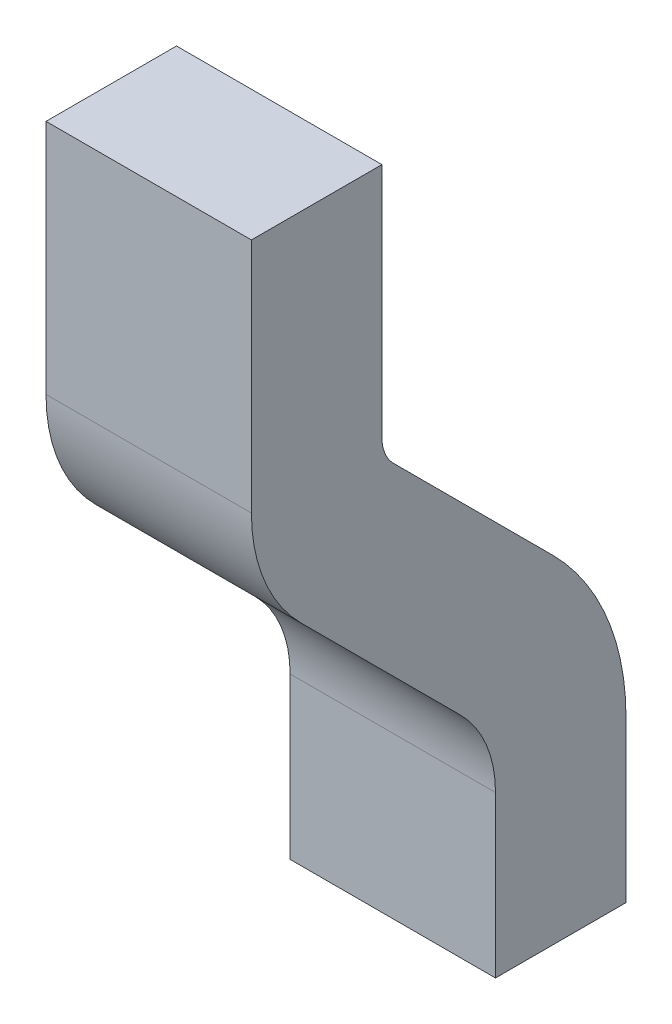
ISO-10303-21;
HEADER;
FILE_DESCRIPTION(('STEP AP214'),'2;1');
FILE_NAME('part.step','',(''),(''),'','','');
FILE_SCHEMA(('AUTOMOTIVE_DESIGN { 1 0 10303 214 1 1 1 1 }'));
ENDSEC;
DATA;
#1=APPLICATION_CONTEXT('core data for automotive mechanical design processes');
#2=APPLICATION_PROTOCOL_DEFINITION('international standard','automotive_design',2000,#1);
#3=PRODUCT_CONTEXT('',#1,'mechanical');
#4=PRODUCT('Part','Part','',(#3));
#5=PRODUCT_RELATED_PRODUCT_CATEGORY('part','',(#4));
#6=PRODUCT_DEFINITION_FORMATION('','',#4);
#7=PRODUCT_DEFINITION_CONTEXT('part definition',#1,'design');
#8=PRODUCT_DEFINITION('design','',#6,#7);
#9=PRODUCT_DEFINITION_SHAPE('','',#8);
#10=(LENGTH_UNIT() NAMED_UNIT(*) SI_UNIT(.MILLI.,.METRE.));
#11=(NAMED_UNIT(*) PLANE_ANGLE_UNIT() SI_UNIT($,.RADIAN.));
#12=(NAMED_UNIT(*) SI_UNIT($,.STERADIAN.) SOLID_ANGLE_UNIT());
#13=UNCERTAINTY_MEASURE_WITH_UNIT(LENGTH_MEASURE(1.E-05),#10,'distance_accuracy_value','');
#14=(GEOMETRIC_REPRESENTATION_CONTEXT(3) GLOBAL_UNCERTAINTY_ASSIGNED_CONTEXT((#13)) GLOBAL_UNIT_ASSIGNED_CONTEXT((#10,
#11,#12)) REPRESENTATION_CONTEXT('',''));
#15=CARTESIAN_POINT('',(0.,0.,0.));
#16=DIRECTION('',(0.,0.,1.));
#17=DIRECTION('',(1.,0.,0.));
#18=AXIS2_PLACEMENT_3D('',#15,#16,#17);
#19=CARTESIAN_POINT('',(5.005,-1.00000000000062,0.54));
#20=DIRECTION('',(0.,0.,1.));
#21=DIRECTION('',(0.707106781186548,0.707106781186548,0.));
#22=AXIS2_PLACEMENT_3D('',#19,#20,#21);
#23=PLANE('',#22);
#24=DIRECTION('',(0.,1.,0.));
#25=VECTOR('',#24,1.);
#26=CARTESIAN_POINT('',(5.005,-1.00000000000062,0.54));
#27=LINE('',#26,#25);
#28=CARTESIAN_POINT('',(5.005,-1.00000000000062,0.54));
#29=VERTEX_POINT('',#28);
#30=CARTESIAN_POINT('',(5.005,-0.335269905174204,0.54));
#31=VERTEX_POINT('',#30);
#32=EDGE_CURVE('E11',#29,#31,#27,.T.);
#33=ORIENTED_EDGE('',*,*,#32,.T.);
#34=DIRECTION('',(-1.,0.,0.));
#35=VECTOR('',#34,1.);
#36=CARTESIAN_POINT('',(5.005,-0.335269905174204,0.54));
#37=LINE('',#36,#35);
#38=CARTESIAN_POINT('',(4.155,-0.335269905174204,0.54));
#39=VERTEX_POINT('',#38);
#40=EDGE_CURVE('E26',#31,#39,#37,.T.);
#41=ORIENTED_EDGE('',*,*,#40,.T.);
#42=DIRECTION('',(0.,1.,0.));
#43=VECTOR('',#42,1.);
#44=CARTESIAN_POINT('',(4.155,-1.00000000000062,0.54));
#45=LINE('',#44,#43);
#46=CARTESIAN_POINT('',(4.155,-1.00000000000062,0.54));
#47=VERTEX_POINT('',#46);
#48=EDGE_CURVE('E172',#47,#39,#45,.T.);
#49=ORIENTED_EDGE('',*,*,#48,.F.);
#50=DIRECTION('',(-1.,0.,0.));
#51=VECTOR('',#50,1.);
#52=CARTESIAN_POINT('',(5.005,-1.00000000000062,0.54));
#53=LINE('',#52,#51);
#54=EDGE_CURVE('E113',#29,#47,#53,.T.);
#55=ORIENTED_EDGE('',*,*,#54,.F.);
#56=EDGE_LOOP('',(#33,#41,#49,#55));
#57=FACE_BOUND('',#56,.T.);
#58=ADVANCED_FACE('F16',(#57),#23,.T.);
#59=CARTESIAN_POINT('',(5.005,0.,0.));
#60=DIRECTION('',(-1.,0.,0.));
#61=DIRECTION('',(0.,0.707106781186548,0.707106781186548));
#62=AXIS2_PLACEMENT_3D('',#59,#60,#61);
#63=PLANE('',#62);
#64=DIRECTION('',(0.,0.,1.));
#65=VECTOR('',#64,1.);
#66=CARTESIAN_POINT('',(5.005,-1.00000000000062,0.));
#67=LINE('',#66,#65);
#68=CARTESIAN_POINT('',(5.005,-1.00000000000062,0.));
#69=VERTEX_POINT('',#68);
#70=EDGE_CURVE('E116',#69,#29,#67,.T.);
#71=ORIENTED_EDGE('',*,*,#70,.F.);
#72=DIRECTION('',(0.,-1.,0.));
#73=VECTOR('',#72,1.);
#74=CARTESIAN_POINT('',(5.005,-0.335269905174204,0.));
#75=LINE('',#74,#73);
#76=CARTESIAN_POINT('',(5.005,-0.335269905174204,0.));
#77=VERTEX_POINT('',#76);
#78=EDGE_CURVE('E125',#77,#69,#75,.T.);
#79=ORIENTED_EDGE('',*,*,#78,.F.);
#80=CARTESIAN_POINT('',(5.005,-0.335269905174204,1.03522017196621));
#81=DIRECTION('',(-1.,0.,0.));
#82=DIRECTION('',(0.,0.707106780945768,-0.707106781427327));
#83=AXIS2_PLACEMENT_3D('',#80,#81,#82);
#84=CIRCLE('',#83,1.03522017196621);
#85=CARTESIAN_POINT('',(5.005,0.396741298194948,0.30320896809854));
#86=VERTEX_POINT('',#85);
#87=EDGE_CURVE('E127',#86,#77,#84,.T.);
#88=ORIENTED_EDGE('',*,*,#87,.F.);
#89=DIRECTION('',(0.,-0.707106781186547,-0.707106781186548));
#90=VECTOR('',#89,1.);
#91=CARTESIAN_POINT('',(5.005,1.05561303280654,0.962080702530221));
#92=LINE('',#91,#90);
#93=CARTESIAN_POINT('',(5.005,1.05561303280654,0.962080702530221));
#94=VERTEX_POINT('',#93);
#95=EDGE_CURVE('E134',#94,#86,#92,.T.);
#96=ORIENTED_EDGE('',*,*,#95,.F.);
#97=CARTESIAN_POINT('',(5.005,1.17130045081576,0.846393284401388));
#98=DIRECTION('',(1.,0.,0.));
#99=DIRECTION('',(0.,0.,1.));
#100=AXIS2_PLACEMENT_3D('',#97,#98,#99);
#101=CIRCLE('',#100,0.163606715598613);
#102=CARTESIAN_POINT('',(5.005,1.17130045081576,1.01));
#103=VERTEX_POINT('',#102);
#104=EDGE_CURVE('E138',#103,#94,#101,.T.);
#105=ORIENTED_EDGE('',*,*,#104,.F.);
#106=DIRECTION('',(0.,-1.,0.));
#107=VECTOR('',#106,1.);
#108=CARTESIAN_POINT('',(5.005,2.14999999999938,1.01));
#109=LINE('',#108,#107);
#110=CARTESIAN_POINT('',(5.005,2.14999999999938,1.01));
#111=VERTEX_POINT('',#110);
#112=EDGE_CURVE('E142',#111,#103,#109,.T.);
#113=ORIENTED_EDGE('',*,*,#112,.F.);
#114=DIRECTION('',(0.,0.,-1.));
#115=VECTOR('',#114,1.);
#116=CARTESIAN_POINT('',(5.005,2.14999999999938,1.55));
#117=LINE('',#116,#115);
#118=CARTESIAN_POINT('',(5.005,2.14999999999938,1.55));
#119=VERTEX_POINT('',#118);
#120=EDGE_CURVE('E146',#119,#111,#117,.T.);
#121=ORIENTED_EDGE('',*,*,#120,.F.);
#122=DIRECTION('',(0.,1.,0.));
#123=VECTOR('',#122,1.);
#124=CARTESIAN_POINT('',(5.005,1.17130045081576,1.55));
#125=LINE('',#124,#123);
#126=CARTESIAN_POINT('',(5.005,1.17130045081576,1.55));
#127=VERTEX_POINT('',#126);
#128=EDGE_CURVE('E150',#127,#119,#125,.T.);
#129=ORIENTED_EDGE('',*,*,#128,.F.);
#130=CARTESIAN_POINT('',(5.005,1.17130045081576,0.846393284401388));
#131=DIRECTION('',(-1.,0.,0.));
#132=DIRECTION('',(0.,-0.707106780820972,0.707106781552123));
#133=AXIS2_PLACEMENT_3D('',#130,#131,#132);
#134=CIRCLE('',#133,0.703606715598613);
#135=CARTESIAN_POINT('',(5.005,0.673775371184803,1.34391836454678));
#136=VERTEX_POINT('',#135);
#137=EDGE_CURVE('E153',#136,#127,#134,.T.);
#138=ORIENTED_EDGE('',*,*,#137,.F.);
#139=DIRECTION('',(0.,0.707106781186547,0.707106781186548));
#140=VECTOR('',#139,1.);
#141=CARTESIAN_POINT('',(5.005,0.0149036364441688,0.685046629849319));
#142=LINE('',#141,#140);
#143=CARTESIAN_POINT('',(5.005,0.0149036364441688,0.685046629849319));
#144=VERTEX_POINT('',#143);
#145=EDGE_CURVE('E156',#144,#136,#142,.T.);
#146=ORIENTED_EDGE('',*,*,#145,.F.);
#147=CARTESIAN_POINT('',(5.005,-0.335269905174204,1.03522017196621));
#148=DIRECTION('',(1.,0.,0.));
#149=DIRECTION('',(0.,0.,-1.));
#150=AXIS2_PLACEMENT_3D('',#147,#148,#149);
#151=CIRCLE('',#150,0.495220171966211);
#152=EDGE_CURVE('E167',#31,#144,#151,.T.);
#153=ORIENTED_EDGE('',*,*,#152,.F.);
#154=ORIENTED_EDGE('',*,*,#32,.F.);
#155=EDGE_LOOP('',(#71,#79,#88,#96,#105,#113,#121,#129,#138,#146,#153,#154));
#156=FACE_BOUND('',#155,.T.);
#157=ADVANCED_FACE('F204',(#156),#63,.F.);
#158=CARTESIAN_POINT('',(5.005,-0.335269905174204,1.03522017196621));
#159=DIRECTION('',(1.,0.,0.));
#160=DIRECTION('',(0.,0.,-1.));
#161=AXIS2_PLACEMENT_3D('',#158,#159,#160);
#162=CYLINDRICAL_SURFACE('',#161,0.495220171966211);
#163=ORIENTED_EDGE('',*,*,#152,.T.);
#164=DIRECTION('',(-1.,0.,0.));
#165=VECTOR('',#164,1.);
#166=CARTESIAN_POINT('',(5.005,0.0149036364441688,0.685046629849319));
#167=LINE('',#166,#165);
#168=CARTESIAN_POINT('',(4.155,0.0149036364441688,0.685046629849319));
#169=VERTEX_POINT('',#168);
#170=EDGE_CURVE('E169',#144,#169,#167,.T.);
#171=ORIENTED_EDGE('',*,*,#170,.T.);
#172=CARTESIAN_POINT('',(4.155,-0.335269905174204,1.03522017196621));
#173=DIRECTION('',(1.,0.,0.));
#174=DIRECTION('',(0.,0.,-1.));
#175=AXIS2_PLACEMENT_3D('',#172,#173,#174);
#176=CIRCLE('',#175,0.495220171966211);
#177=EDGE_CURVE('E173',#39,#169,#176,.T.);
#178=ORIENTED_EDGE('',*,*,#177,.F.);
#179=ORIENTED_EDGE('',*,*,#40,.F.);
#180=EDGE_LOOP('',(#163,#171,#178,#179));
#181=FACE_BOUND('',#180,.T.);
#182=ADVANCED_FACE('F227',(#181),#162,.F.);
#183=CARTESIAN_POINT('',(4.155,0.,0.));
#184=DIRECTION('',(-1.,0.,0.));
#185=DIRECTION('',(0.,0.707106781186548,0.707106781186548));
#186=AXIS2_PLACEMENT_3D('',#183,#184,#185);
#187=PLANE('',#186);
#188=ORIENTED_EDGE('',*,*,#48,.T.);
#189=ORIENTED_EDGE('',*,*,#177,.T.);
#190=DIRECTION('',(0.,0.707106781186547,0.707106781186548));
#191=VECTOR('',#190,1.);
#192=CARTESIAN_POINT('',(4.155,0.0149036364441688,0.685046629849319));
#193=LINE('',#192,#191);
#194=CARTESIAN_POINT('',(4.155,0.673775371184803,1.34391836454678));
#195=VERTEX_POINT('',#194);
#196=EDGE_CURVE('E175',#169,#195,#193,.T.);
#197=ORIENTED_EDGE('',*,*,#196,.T.);
#198=CARTESIAN_POINT('',(4.155,1.17130045081576,0.846393284401388));
#199=DIRECTION('',(-1.,0.,0.));
#200=DIRECTION('',(0.,-0.707106780820972,0.707106781552123));
#201=AXIS2_PLACEMENT_3D('',#198,#199,#200);
#202=CIRCLE('',#201,0.703606715598613);
#203=CARTESIAN_POINT('',(4.155,1.17130045081576,1.55));
#204=VERTEX_POINT('',#203);
#205=EDGE_CURVE('E178',#195,#204,#202,.T.);
#206=ORIENTED_EDGE('',*,*,#205,.T.);
#207=DIRECTION('',(0.,1.,0.));
#208=VECTOR('',#207,1.);
#209=CARTESIAN_POINT('',(4.155,1.17130045081576,1.55));
#210=LINE('',#209,#208);
#211=CARTESIAN_POINT('',(4.155,2.14999999999938,1.55));
#212=VERTEX_POINT('',#211);
#213=EDGE_CURVE('E181',#204,#212,#210,.T.);
#214=ORIENTED_EDGE('',*,*,#213,.T.);
#215=DIRECTION('',(0.,0.,-1.));
#216=VECTOR('',#215,1.);
#217=CARTESIAN_POINT('',(4.155,2.14999999999938,1.55));
#218=LINE('',#217,#216);
#219=CARTESIAN_POINT('',(4.155,2.14999999999938,1.01));
#220=VERTEX_POINT('',#219);
#221=EDGE_CURVE('E184',#212,#220,#218,.T.);
#222=ORIENTED_EDGE('',*,*,#221,.T.);
#223=DIRECTION('',(0.,-1.,0.));
#224=VECTOR('',#223,1.);
#225=CARTESIAN_POINT('',(4.155,2.14999999999938,1.01));
#226=LINE('',#225,#224);
#227=CARTESIAN_POINT('',(4.155,1.17130045081576,1.01));
#228=VERTEX_POINT('',#227);
#229=EDGE_CURVE('E187',#220,#228,#226,.T.);
#230=ORIENTED_EDGE('',*,*,#229,.T.);
#231=CARTESIAN_POINT('',(4.155,1.17130045081576,0.846393284401388));
#232=DIRECTION('',(1.,0.,0.));
#233=DIRECTION('',(0.,0.,1.));
#234=AXIS2_PLACEMENT_3D('',#231,#232,#233);
#235=CIRCLE('',#234,0.163606715598613);
#236=CARTESIAN_POINT('',(4.155,1.05561303280654,0.962080702530221));
#237=VERTEX_POINT('',#236);
#238=EDGE_CURVE('E190',#228,#237,#235,.T.);
#239=ORIENTED_EDGE('',*,*,#238,.T.);
#240=DIRECTION('',(0.,-0.707106781186547,-0.707106781186548));
#241=VECTOR('',#240,1.);
#242=CARTESIAN_POINT('',(4.155,1.05561303280654,0.962080702530221));
#243=LINE('',#242,#241);
#244=CARTESIAN_POINT('',(4.155,0.396741298194948,0.30320896809854));
#245=VERTEX_POINT('',#244);
#246=EDGE_CURVE('E193',#237,#245,#243,.T.);
#247=ORIENTED_EDGE('',*,*,#246,.T.);
#248=CARTESIAN_POINT('',(4.155,-0.335269905174204,1.03522017196621));
#249=DIRECTION('',(-1.,0.,0.));
#250=DIRECTION('',(0.,0.707106780945768,-0.707106781427327));
#251=AXIS2_PLACEMENT_3D('',#248,#249,#250);
#252=CIRCLE('',#251,1.03522017196621);
#253=CARTESIAN_POINT('',(4.155,-0.335269905174204,0.));
#254=VERTEX_POINT('',#253);
#255=EDGE_CURVE('E120',#245,#254,#252,.T.);
#256=ORIENTED_EDGE('',*,*,#255,.T.);
#257=DIRECTION('',(0.,-1.,0.));
#258=VECTOR('',#257,1.);
#259=CARTESIAN_POINT('',(4.155,-0.335269905174204,0.));
#260=LINE('',#259,#258);
#261=CARTESIAN_POINT('',(4.155,-1.00000000000062,0.));
#262=VERTEX_POINT('',#261);
#263=EDGE_CURVE('E102',#254,#262,#260,.T.);
#264=ORIENTED_EDGE('',*,*,#263,.T.);
#265=DIRECTION('',(0.,0.,1.));
#266=VECTOR('',#265,1.);
#267=CARTESIAN_POINT('',(4.155,-1.00000000000062,0.));
#268=LINE('',#267,#266);
#269=EDGE_CURVE('E108',#262,#47,#268,.T.);
#270=ORIENTED_EDGE('',*,*,#269,.T.);
#271=EDGE_LOOP('',(#188,#189,#197,#206,#214,#222,#230,#239,#247,#256,#264,#270));
#272=FACE_BOUND('',#271,.T.);
#273=ADVANCED_FACE('F118',(#272),#187,.T.);
#274=CARTESIAN_POINT('',(5.005,-1.00000000000062,0.));
#275=DIRECTION('',(0.,-1.,0.));
#276=DIRECTION('',(0.707106781186548,0.,0.707106781186548));
#277=AXIS2_PLACEMENT_3D('',#274,#275,#276);
#278=PLANE('',#277);
#279=ORIENTED_EDGE('',*,*,#70,.T.);
#280=ORIENTED_EDGE('',*,*,#54,.T.);
#281=ORIENTED_EDGE('',*,*,#269,.F.);
#282=DIRECTION('',(-1.,0.,0.));
#283=VECTOR('',#282,1.);
#284=CARTESIAN_POINT('',(5.005,-1.00000000000062,0.));
#285=LINE('',#284,#283);
#286=EDGE_CURVE('E111',#69,#262,#285,.T.);
#287=ORIENTED_EDGE('',*,*,#286,.F.);
#288=EDGE_LOOP('',(#279,#280,#281,#287));
#289=FACE_BOUND('',#288,.T.);
#290=ADVANCED_FACE('F110',(#289),#278,.T.);
#291=CARTESIAN_POINT('',(5.005,-0.335269905174204,0.));
#292=DIRECTION('',(0.,0.,-1.));
#293=DIRECTION('',(0.707106781186548,0.707106781186548,0.));
#294=AXIS2_PLACEMENT_3D('',#291,#292,#293);
#295=PLANE('',#294);
#296=ORIENTED_EDGE('',*,*,#78,.T.);
#297=ORIENTED_EDGE('',*,*,#286,.T.);
#298=ORIENTED_EDGE('',*,*,#263,.F.);
#299=DIRECTION('',(-1.,0.,0.));
#300=VECTOR('',#299,1.);
#301=CARTESIAN_POINT('',(5.005,-0.335269905174204,0.));
#302=LINE('',#301,#300);
#303=EDGE_CURVE('E130',#77,#254,#302,.T.);
#304=ORIENTED_EDGE('',*,*,#303,.F.);
#305=EDGE_LOOP('',(#296,#297,#298,#304));
#306=FACE_BOUND('',#305,.T.);
#307=ADVANCED_FACE('F123',(#306),#295,.T.);
#308=CARTESIAN_POINT('',(5.005,-0.335269905174204,1.03522017196621));
#309=DIRECTION('',(-1.,0.,0.));
#310=DIRECTION('',(0.,0.707106780945768,-0.707106781427327));
#311=AXIS2_PLACEMENT_3D('',#308,#309,#310);
#312=CYLINDRICAL_SURFACE('',#311,1.03522017196621);
#313=ORIENTED_EDGE('',*,*,#87,.T.);
#314=ORIENTED_EDGE('',*,*,#303,.T.);
#315=ORIENTED_EDGE('',*,*,#255,.F.);
#316=DIRECTION('',(-1.,0.,0.));
#317=VECTOR('',#316,1.);
#318=CARTESIAN_POINT('',(5.005,0.396741298284904,0.303208968008583));
#319=LINE('',#318,#317);
#320=EDGE_CURVE('E135',#86,#245,#319,.T.);
#321=ORIENTED_EDGE('',*,*,#320,.F.);
#322=EDGE_LOOP('',(#313,#314,#315,#321));
#323=FACE_BOUND('',#322,.T.);
#324=ADVANCED_FACE('F202',(#323),#312,.T.);
#325=CARTESIAN_POINT('',(5.005,1.05561303280654,0.962080702530221));
#326=DIRECTION('',(0.,0.707106781186548,-0.707106781186547));
#327=DIRECTION('',(0.577350269189626,0.577350269189625,0.577350269189626));
#328=AXIS2_PLACEMENT_3D('',#325,#326,#327);
#329=PLANE('',#328);
#330=ORIENTED_EDGE('',*,*,#95,.T.);
#331=ORIENTED_EDGE('',*,*,#320,.T.);
#332=ORIENTED_EDGE('',*,*,#246,.F.);
#333=DIRECTION('',(-1.,0.,0.));
#334=VECTOR('',#333,1.);
#335=CARTESIAN_POINT('',(5.005,1.05561303280654,0.962080702530221));
#336=LINE('',#335,#334);
#337=EDGE_CURVE('E139',#94,#237,#336,.T.);
#338=ORIENTED_EDGE('',*,*,#337,.F.);
#339=EDGE_LOOP('',(#330,#331,#332,#338));
#340=FACE_BOUND('',#339,.T.);
#341=ADVANCED_FACE('F198',(#340),#329,.T.);
#342=CARTESIAN_POINT('',(5.005,1.17130045081576,0.846393284401388));
#343=DIRECTION('',(1.,0.,0.));
#344=DIRECTION('',(0.,0.,1.));
#345=AXIS2_PLACEMENT_3D('',#342,#343,#344);
#346=CYLINDRICAL_SURFACE('',#345,0.163606715598613);
#347=ORIENTED_EDGE('',*,*,#104,.T.);
#348=ORIENTED_EDGE('',*,*,#337,.T.);
#349=ORIENTED_EDGE('',*,*,#238,.F.);
#350=DIRECTION('',(-1.,0.,0.));
#351=VECTOR('',#350,1.);
#352=CARTESIAN_POINT('',(5.005,1.17130045081576,1.01));
#353=LINE('',#352,#351);
#354=EDGE_CURVE('E143',#103,#228,#353,.T.);
#355=ORIENTED_EDGE('',*,*,#354,.F.);
#356=EDGE_LOOP('',(#347,#348,#349,#355));
#357=FACE_BOUND('',#356,.T.);
#358=ADVANCED_FACE('F250',(#357),#346,.F.);
#359=CARTESIAN_POINT('',(5.005,2.14999999999938,1.01));
#360=DIRECTION('',(0.,0.,-1.));
#361=DIRECTION('',(0.707106781186548,0.707106781186548,0.));
#362=AXIS2_PLACEMENT_3D('',#359,#360,#361);
#363=PLANE('',#362);
#364=ORIENTED_EDGE('',*,*,#112,.T.);
#365=ORIENTED_EDGE('',*,*,#354,.T.);
#366=ORIENTED_EDGE('',*,*,#229,.F.);
#367=DIRECTION('',(-1.,0.,0.));
#368=VECTOR('',#367,1.);
#369=CARTESIAN_POINT('',(5.005,2.14999999999938,1.01));
#370=LINE('',#369,#368);
#371=EDGE_CURVE('E147',#111,#220,#370,.T.);
#372=ORIENTED_EDGE('',*,*,#371,.F.);
#373=EDGE_LOOP('',(#364,#365,#366,#372));
#374=FACE_BOUND('',#373,.T.);
#375=ADVANCED_FACE('F253',(#374),#363,.T.);
#376=CARTESIAN_POINT('',(5.005,2.14999999999938,1.55));
#377=DIRECTION('',(0.,1.,0.));
#378=DIRECTION('',(0.707106781186548,0.,0.707106781186548));
#379=AXIS2_PLACEMENT_3D('',#376,#377,#378);
#380=PLANE('',#379);
#381=ORIENTED_EDGE('',*,*,#120,.T.);
#382=ORIENTED_EDGE('',*,*,#371,.T.);
#383=ORIENTED_EDGE('',*,*,#221,.F.);
#384=DIRECTION('',(-1.,0.,0.));
#385=VECTOR('',#384,1.);
#386=CARTESIAN_POINT('',(5.005,2.14999999999938,1.55));
#387=LINE('',#386,#385);
#388=EDGE_CURVE('E151',#119,#212,#387,.T.);
#389=ORIENTED_EDGE('',*,*,#388,.F.);
#390=EDGE_LOOP('',(#381,#382,#383,#389));
#391=FACE_BOUND('',#390,.T.);
#392=ADVANCED_FACE('F223',(#391),#380,.T.);
#393=CARTESIAN_POINT('',(5.005,1.17130045081576,1.55));
#394=DIRECTION('',(0.,0.,1.));
#395=DIRECTION('',(0.707106781186548,0.707106781186548,0.));
#396=AXIS2_PLACEMENT_3D('',#393,#394,#395);
#397=PLANE('',#396);
#398=ORIENTED_EDGE('',*,*,#128,.T.);
#399=ORIENTED_EDGE('',*,*,#388,.T.);
#400=ORIENTED_EDGE('',*,*,#213,.F.);
#401=DIRECTION('',(-1.,0.,0.));
#402=VECTOR('',#401,1.);
#403=CARTESIAN_POINT('',(5.005,1.17130045081576,1.55));
#404=LINE('',#403,#402);
#405=EDGE_CURVE('E154',#127,#204,#404,.T.);
#406=ORIENTED_EDGE('',*,*,#405,.F.);
#407=EDGE_LOOP('',(#398,#399,#400,#406));
#408=FACE_BOUND('',#407,.T.);
#409=ADVANCED_FACE('F217',(#408),#397,.T.);
#410=CARTESIAN_POINT('',(5.005,1.17130045081576,0.846393284401388));
#411=DIRECTION('',(-1.,0.,0.));
#412=DIRECTION('',(0.,-0.707106780820972,0.707106781552123));
#413=AXIS2_PLACEMENT_3D('',#410,#411,#412);
#414=CYLINDRICAL_SURFACE('',#413,0.703606715598613);
#415=ORIENTED_EDGE('',*,*,#137,.T.);
#416=ORIENTED_EDGE('',*,*,#405,.T.);
#417=ORIENTED_EDGE('',*,*,#205,.F.);
#418=DIRECTION('',(-1.,0.,0.));
#419=VECTOR('',#418,1.);
#420=CARTESIAN_POINT('',(5.005,0.673775370965807,1.34391836437096));
#421=LINE('',#420,#419);
#422=EDGE_CURVE('E20',#136,#195,#421,.T.);
#423=ORIENTED_EDGE('',*,*,#422,.F.);
#424=EDGE_LOOP('',(#415,#416,#417,#423));
#425=FACE_BOUND('',#424,.T.);
#426=ADVANCED_FACE('F226',(#425),#414,.T.);
#427=CARTESIAN_POINT('',(5.005,0.0149036364441688,0.685046629849319));
#428=DIRECTION('',(0.,-0.707106781186548,0.707106781186547));
#429=DIRECTION('',(0.577350269189626,0.577350269189625,0.577350269189626));
#430=AXIS2_PLACEMENT_3D('',#427,#428,#429);
#431=PLANE('',#430);
#432=ORIENTED_EDGE('',*,*,#145,.T.);
#433=ORIENTED_EDGE('',*,*,#422,.T.);
#434=ORIENTED_EDGE('',*,*,#196,.F.);
#435=ORIENTED_EDGE('',*,*,#170,.F.);
#436=EDGE_LOOP('',(#432,#433,#434,#435));
#437=FACE_BOUND('',#436,.T.);
#438=ADVANCED_FACE('F18',(#437),#431,.T.);
#439=CLOSED_SHELL('',(#58,#157,#182,#273,#290,#307,#324,#341,#358,#375,#392,#409,#426,#438));
#440=MANIFOLD_SOLID_BREP('B1',#439);
#441=ADVANCED_BREP_SHAPE_REPRESENTATION('',(#18,#440),#14);
#442=SHAPE_DEFINITION_REPRESENTATION(#9,#441);
ENDSEC;
END-ISO-10303-21;
